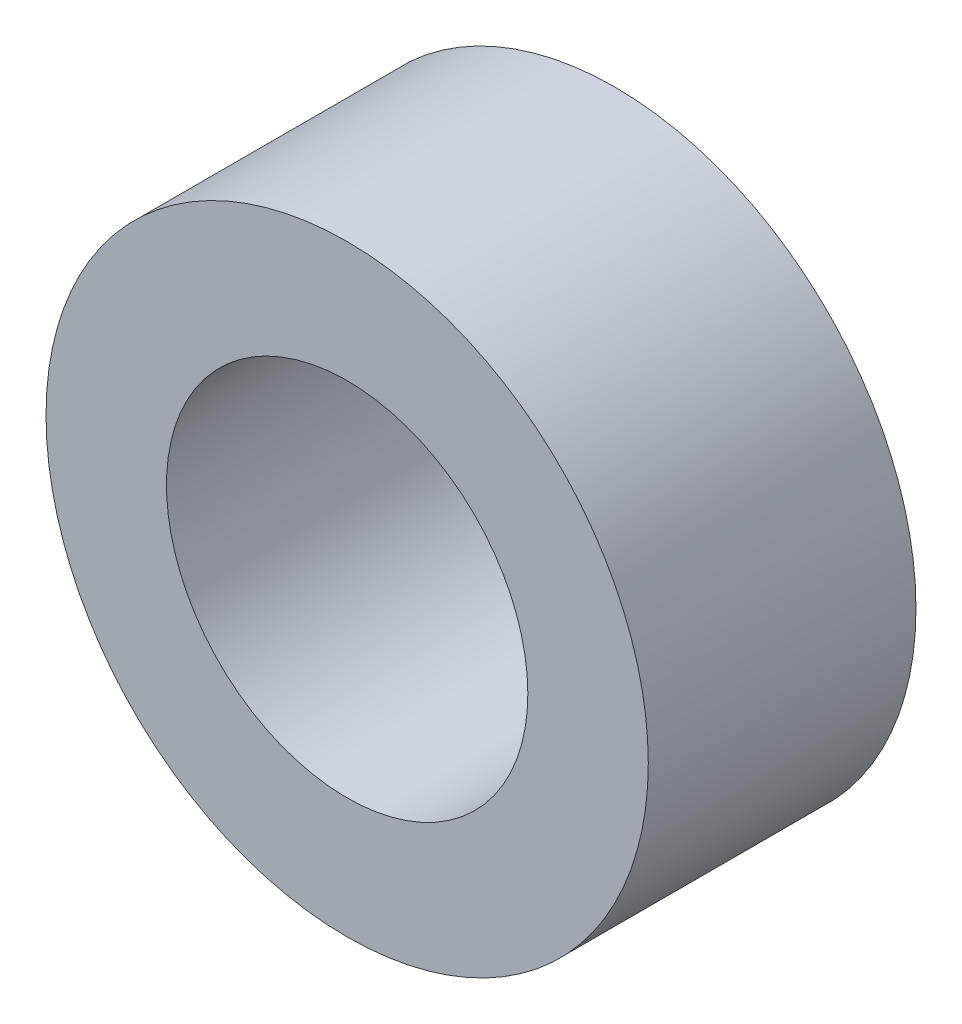
ISO-10303-21;
HEADER;
FILE_DESCRIPTION(('STEP AP214'),'2;1');
FILE_NAME('part.step','',(''),(''),'','','');
FILE_SCHEMA(('AUTOMOTIVE_DESIGN { 1 0 10303 214 1 1 1 1 }'));
ENDSEC;
DATA;
#1=APPLICATION_CONTEXT('core data for automotive mechanical design processes');
#2=APPLICATION_PROTOCOL_DEFINITION('international standard','automotive_design',2000,#1);
#3=PRODUCT_CONTEXT('',#1,'mechanical');
#4=PRODUCT('Part','Part','',(#3));
#5=PRODUCT_RELATED_PRODUCT_CATEGORY('part','',(#4));
#6=PRODUCT_DEFINITION_FORMATION('','',#4);
#7=PRODUCT_DEFINITION_CONTEXT('part definition',#1,'design');
#8=PRODUCT_DEFINITION('design','',#6,#7);
#9=PRODUCT_DEFINITION_SHAPE('','',#8);
#10=(LENGTH_UNIT() NAMED_UNIT(*) SI_UNIT(.MILLI.,.METRE.));
#11=(NAMED_UNIT(*) PLANE_ANGLE_UNIT() SI_UNIT($,.RADIAN.));
#12=(NAMED_UNIT(*) SI_UNIT($,.STERADIAN.) SOLID_ANGLE_UNIT());
#13=UNCERTAINTY_MEASURE_WITH_UNIT(LENGTH_MEASURE(1.E-05),#10,'distance_accuracy_value','');
#14=(GEOMETRIC_REPRESENTATION_CONTEXT(3) GLOBAL_UNCERTAINTY_ASSIGNED_CONTEXT((#13)) GLOBAL_UNIT_ASSIGNED_CONTEXT((#10,
#11,#12)) REPRESENTATION_CONTEXT('',''));
#15=CARTESIAN_POINT('',(0.,0.,0.));
#16=DIRECTION('',(0.,0.,1.));
#17=DIRECTION('',(1.,0.,0.));
#18=AXIS2_PLACEMENT_3D('',#15,#16,#17);
#19=CARTESIAN_POINT('',(0.,0.,1.));
#20=DIRECTION('',(0.,0.,1.));
#21=DIRECTION('',(1.,0.,0.));
#22=AXIS2_PLACEMENT_3D('',#19,#20,#21);
#23=PLANE('',#22);
#24=CARTESIAN_POINT('',(0.,0.,1.));
#25=DIRECTION('',(0.,0.,1.));
#26=DIRECTION('',(1.,0.,0.));
#27=AXIS2_PLACEMENT_3D('',#24,#25,#26);
#28=CIRCLE('',#27,2.25);
#29=CARTESIAN_POINT('',(2.25,0.,1.));
#30=VERTEX_POINT('',#29);
#31=EDGE_CURVE('E10',#30,#30,#28,.T.);
#32=ORIENTED_EDGE('',*,*,#31,.T.);
#33=EDGE_LOOP('',(#32));
#34=FACE_BOUND('',#33,.T.);
#35=CARTESIAN_POINT('',(0.,0.,1.));
#36=DIRECTION('',(0.,0.,1.));
#37=DIRECTION('',(1.,0.,0.));
#38=AXIS2_PLACEMENT_3D('',#35,#36,#37);
#39=CIRCLE('',#38,1.35);
#40=CARTESIAN_POINT('',(1.35,0.,1.));
#41=VERTEX_POINT('',#40);
#42=EDGE_CURVE('E41',#41,#41,#39,.T.);
#43=ORIENTED_EDGE('',*,*,#42,.F.);
#44=EDGE_LOOP('',(#43));
#45=FACE_BOUND('',#44,.T.);
#46=ADVANCED_FACE('F30',(#34,#45),#23,.T.);
#47=CARTESIAN_POINT('',(0.,0.,-1.));
#48=DIRECTION('',(0.,0.,1.));
#49=DIRECTION('',(1.,0.,0.));
#50=AXIS2_PLACEMENT_3D('',#47,#48,#49);
#51=PLANE('',#50);
#52=CARTESIAN_POINT('',(0.,0.,-1.));
#53=DIRECTION('',(0.,0.,1.));
#54=DIRECTION('',(1.,0.,0.));
#55=AXIS2_PLACEMENT_3D('',#52,#53,#54);
#56=CIRCLE('',#55,2.25);
#57=CARTESIAN_POINT('',(2.25,0.,-1.));
#58=VERTEX_POINT('',#57);
#59=EDGE_CURVE('E34',#58,#58,#56,.T.);
#60=ORIENTED_EDGE('',*,*,#59,.F.);
#61=EDGE_LOOP('',(#60));
#62=FACE_BOUND('',#61,.T.);
#63=CARTESIAN_POINT('',(0.,0.,-1.));
#64=DIRECTION('',(0.,0.,1.));
#65=DIRECTION('',(1.,0.,0.));
#66=AXIS2_PLACEMENT_3D('',#63,#64,#65);
#67=CIRCLE('',#66,1.35);
#68=CARTESIAN_POINT('',(1.35,0.,-1.));
#69=VERTEX_POINT('',#68);
#70=EDGE_CURVE('E43',#69,#69,#67,.T.);
#71=ORIENTED_EDGE('',*,*,#70,.T.);
#72=EDGE_LOOP('',(#71));
#73=FACE_BOUND('',#72,.T.);
#74=ADVANCED_FACE('F53',(#62,#73),#51,.F.);
#75=CARTESIAN_POINT('',(0.,0.,1.));
#76=DIRECTION('',(0.,0.,-1.));
#77=DIRECTION('',(-1.,0.,0.));
#78=AXIS2_PLACEMENT_3D('',#75,#76,#77);
#79=CYLINDRICAL_SURFACE('',#78,2.25);
#80=ORIENTED_EDGE('',*,*,#31,.F.);
#81=EDGE_LOOP('',(#80));
#82=FACE_BOUND('',#81,.T.);
#83=ORIENTED_EDGE('',*,*,#59,.T.);
#84=EDGE_LOOP('',(#83));
#85=FACE_BOUND('',#84,.T.);
#86=ADVANCED_FACE('F32',(#82,#85),#79,.T.);
#87=CARTESIAN_POINT('',(0.,0.,1.));
#88=DIRECTION('',(0.,0.,-1.));
#89=DIRECTION('',(-1.,0.,0.));
#90=AXIS2_PLACEMENT_3D('',#87,#88,#89);
#91=CYLINDRICAL_SURFACE('',#90,1.35);
#92=ORIENTED_EDGE('',*,*,#42,.T.);
#93=EDGE_LOOP('',(#92));
#94=FACE_BOUND('',#93,.T.);
#95=ORIENTED_EDGE('',*,*,#70,.F.);
#96=EDGE_LOOP('',(#95));
#97=FACE_BOUND('',#96,.T.);
#98=ADVANCED_FACE('F49',(#94,#97),#91,.F.);
#99=CLOSED_SHELL('',(#46,#74,#86,#98));
#100=MANIFOLD_SOLID_BREP('B2',#99);
#101=ADVANCED_BREP_SHAPE_REPRESENTATION('',(#18,#100),#14);
#102=SHAPE_DEFINITION_REPRESENTATION(#9,#101);
ENDSEC;
END-ISO-10303-21;
